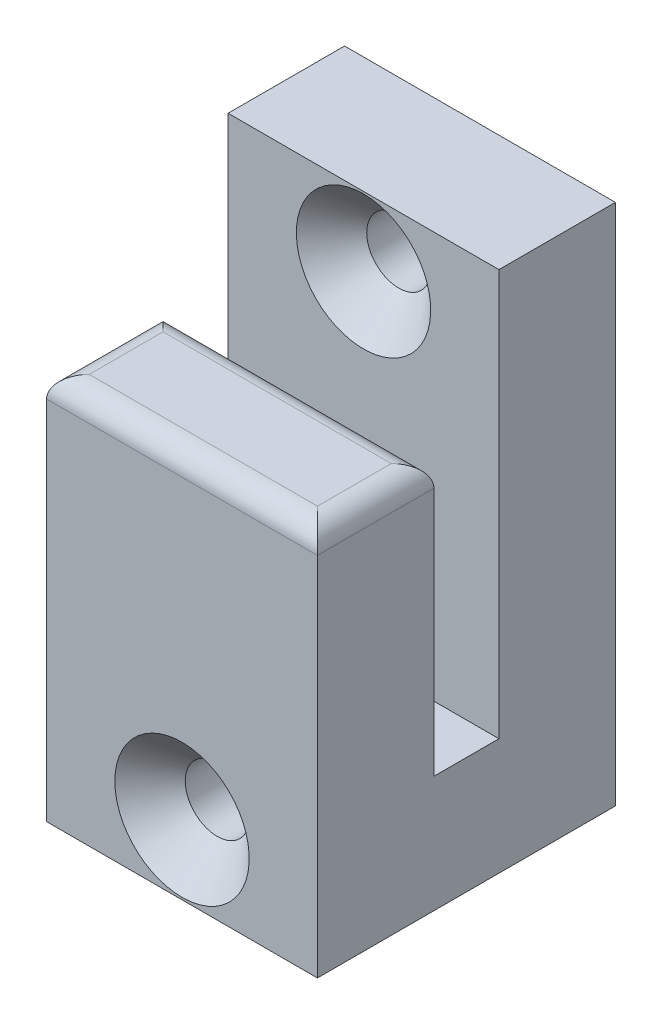
ISO-10303-21;
HEADER;
FILE_DESCRIPTION(('STEP AP214'),'2;1');
FILE_NAME('part.step','',(''),(''),'','','');
FILE_SCHEMA(('AUTOMOTIVE_DESIGN { 1 0 10303 214 1 1 1 1 }'));
ENDSEC;
DATA;
#1=APPLICATION_CONTEXT('core data for automotive mechanical design processes');
#2=APPLICATION_PROTOCOL_DEFINITION('international standard','automotive_design',2000,#1);
#3=PRODUCT_CONTEXT('',#1,'mechanical');
#4=PRODUCT('Part','Part','',(#3));
#5=PRODUCT_RELATED_PRODUCT_CATEGORY('part','',(#4));
#6=PRODUCT_DEFINITION_FORMATION('','',#4);
#7=PRODUCT_DEFINITION_CONTEXT('part definition',#1,'design');
#8=PRODUCT_DEFINITION('design','',#6,#7);
#9=PRODUCT_DEFINITION_SHAPE('','',#8);
#10=(LENGTH_UNIT() NAMED_UNIT(*) SI_UNIT(.MILLI.,.METRE.));
#11=(NAMED_UNIT(*) PLANE_ANGLE_UNIT() SI_UNIT($,.RADIAN.));
#12=(NAMED_UNIT(*) SI_UNIT($,.STERADIAN.) SOLID_ANGLE_UNIT());
#13=UNCERTAINTY_MEASURE_WITH_UNIT(LENGTH_MEASURE(1.E-05),#10,'distance_accuracy_value','');
#14=(GEOMETRIC_REPRESENTATION_CONTEXT(3) GLOBAL_UNCERTAINTY_ASSIGNED_CONTEXT((#13)) GLOBAL_UNIT_ASSIGNED_CONTEXT((#10,
#11,#12)) REPRESENTATION_CONTEXT('',''));
#15=CARTESIAN_POINT('',(0.,0.,0.));
#16=DIRECTION('',(0.,0.,1.));
#17=DIRECTION('',(1.,0.,0.));
#18=AXIS2_PLACEMENT_3D('',#15,#16,#17);
#19=CARTESIAN_POINT('',(25.4,-20.8635297619048,11.8928333333333));
#20=DIRECTION('',(0.,0.,-1.));
#21=DIRECTION('',(-1.,0.,0.));
#22=AXIS2_PLACEMENT_3D('',#19,#20,#21);
#23=PLANE('',#22);
#24=CARTESIAN_POINT('',(12.7,-14.3635297619048,11.8928333333333));
#25=DIRECTION('',(0.,0.,-1.));
#26=DIRECTION('',(-1.,0.,0.));
#27=AXIS2_PLACEMENT_3D('',#24,#25,#26);
#28=CIRCLE('',#27,6.3);
#29=CARTESIAN_POINT('',(6.39999999999999,-14.3635297619048,11.8928333333333));
#30=VERTEX_POINT('',#29);
#31=EDGE_CURVE('E150',#30,#30,#28,.T.);
#32=ORIENTED_EDGE('',*,*,#31,.T.);
#33=EDGE_LOOP('',(#32));
#34=FACE_BOUND('',#33,.T.);
#35=DIRECTION('',(0.,-1.,0.));
#36=VECTOR('',#35,1.);
#37=CARTESIAN_POINT('',(25.4,-20.8635297619048,11.8928333333333));
#38=LINE('',#37,#36);
#39=CARTESIAN_POINT('',(25.4,13.4584702380952,11.8928333333333));
#40=VERTEX_POINT('',#39);
#41=CARTESIAN_POINT('',(25.4,-20.8635297619048,11.8928333333333));
#42=VERTEX_POINT('',#41);
#43=EDGE_CURVE('E128',#40,#42,#38,.T.);
#44=ORIENTED_EDGE('',*,*,#43,.F.);
#45=DIRECTION('',(-1.,0.,0.));
#46=VECTOR('',#45,1.);
#47=CARTESIAN_POINT('',(25.4,13.4584702380952,11.8928333333333));
#48=LINE('',#47,#46);
#49=CARTESIAN_POINT('',(0.,13.4584702380952,11.8928333333333));
#50=VERTEX_POINT('',#49);
#51=EDGE_CURVE('E62',#40,#50,#48,.T.);
#52=ORIENTED_EDGE('',*,*,#51,.T.);
#53=DIRECTION('',(0.,-1.,0.));
#54=VECTOR('',#53,1.);
#55=CARTESIAN_POINT('',(0.,-20.8635297619048,11.8928333333333));
#56=LINE('',#55,#54);
#57=CARTESIAN_POINT('',(0.,-20.8635297619048,11.8928333333333));
#58=VERTEX_POINT('',#57);
#59=EDGE_CURVE('E147',#50,#58,#56,.T.);
#60=ORIENTED_EDGE('',*,*,#59,.T.);
#61=DIRECTION('',(-1.,0.,0.));
#62=VECTOR('',#61,1.);
#63=CARTESIAN_POINT('',(25.4,-20.8635297619048,11.8928333333333));
#64=LINE('',#63,#62);
#65=EDGE_CURVE('E140',#42,#58,#64,.T.);
#66=ORIENTED_EDGE('',*,*,#65,.F.);
#67=EDGE_LOOP('',(#44,#52,#60,#66));
#68=FACE_BOUND('',#67,.T.);
#69=ADVANCED_FACE('F52',(#34,#68),#23,.F.);
#70=CARTESIAN_POINT('',(25.4,-20.8635297619048,-16.0511666666667));
#71=DIRECTION('',(0.,1.,0.));
#72=DIRECTION('',(0.,0.,1.));
#73=AXIS2_PLACEMENT_3D('',#70,#71,#72);
#74=PLANE('',#73);
#75=DIRECTION('',(0.,0.,-1.));
#76=VECTOR('',#75,1.);
#77=CARTESIAN_POINT('',(0.,-20.8635297619048,-16.0511666666667));
#78=LINE('',#77,#76);
#79=CARTESIAN_POINT('',(0.,-20.8635297619048,-16.0511666666667));
#80=VERTEX_POINT('',#79);
#81=EDGE_CURVE('E203',#58,#80,#78,.T.);
#82=ORIENTED_EDGE('',*,*,#81,.T.);
#83=DIRECTION('',(-1.,0.,0.));
#84=VECTOR('',#83,1.);
#85=CARTESIAN_POINT('',(25.4,-20.8635297619048,-16.0511666666667));
#86=LINE('',#85,#84);
#87=CARTESIAN_POINT('',(25.4,-20.8635297619048,-16.0511666666667));
#88=VERTEX_POINT('',#87);
#89=EDGE_CURVE('E142',#88,#80,#86,.T.);
#90=ORIENTED_EDGE('',*,*,#89,.F.);
#91=DIRECTION('',(0.,0.,-1.));
#92=VECTOR('',#91,1.);
#93=CARTESIAN_POINT('',(25.4,-20.8635297619048,-16.0511666666667));
#94=LINE('',#93,#92);
#95=EDGE_CURVE('E131',#42,#88,#94,.T.);
#96=ORIENTED_EDGE('',*,*,#95,.F.);
#97=ORIENTED_EDGE('',*,*,#65,.T.);
#98=EDGE_LOOP('',(#82,#90,#96,#97));
#99=FACE_BOUND('',#98,.T.);
#100=ADVANCED_FACE('F139',(#99),#74,.F.);
#101=CARTESIAN_POINT('',(25.4,-20.8635297619048,-16.0511666666667));
#102=DIRECTION('',(0.,0.,1.));
#103=DIRECTION('',(1.,0.,0.));
#104=AXIS2_PLACEMENT_3D('',#101,#102,#103);
#105=PLANE('',#104);
#106=CARTESIAN_POINT('',(12.7,21.6584702380952,-16.0511666666667));
#107=DIRECTION('',(0.,0.,-1.));
#108=DIRECTION('',(-1.,0.,0.));
#109=AXIS2_PLACEMENT_3D('',#106,#107,#108);
#110=CIRCLE('',#109,3.);
#111=CARTESIAN_POINT('',(9.7,21.6584702380952,-16.0511666666667));
#112=VERTEX_POINT('',#111);
#113=EDGE_CURVE('E174',#112,#112,#110,.T.);
#114=ORIENTED_EDGE('',*,*,#113,.F.);
#115=EDGE_LOOP('',(#114));
#116=FACE_BOUND('',#115,.T.);
#117=CARTESIAN_POINT('',(12.7,-14.3635297619048,-16.0511666666667));
#118=DIRECTION('',(0.,0.,-1.));
#119=DIRECTION('',(-1.,0.,0.));
#120=AXIS2_PLACEMENT_3D('',#117,#118,#119);
#121=CIRCLE('',#120,3.);
#122=CARTESIAN_POINT('',(9.7,-14.3635297619048,-16.0511666666667));
#123=VERTEX_POINT('',#122);
#124=EDGE_CURVE('E170',#123,#123,#121,.T.);
#125=ORIENTED_EDGE('',*,*,#124,.F.);
#126=EDGE_LOOP('',(#125));
#127=FACE_BOUND('',#126,.T.);
#128=DIRECTION('',(0.,1.,0.));
#129=VECTOR('',#128,1.);
#130=CARTESIAN_POINT('',(0.,-20.8635297619048,-16.0511666666667));
#131=LINE('',#130,#129);
#132=CARTESIAN_POINT('',(0.,28.1584702380952,-16.0511666666667));
#133=VERTEX_POINT('',#132);
#134=EDGE_CURVE('E206',#80,#133,#131,.T.);
#135=ORIENTED_EDGE('',*,*,#134,.T.);
#136=DIRECTION('',(-1.,0.,0.));
#137=VECTOR('',#136,1.);
#138=CARTESIAN_POINT('',(25.4,28.1584702380952,-16.0511666666667));
#139=LINE('',#138,#137);
#140=CARTESIAN_POINT('',(25.4,28.1584702380952,-16.0511666666667));
#141=VERTEX_POINT('',#140);
#142=EDGE_CURVE('E158',#141,#133,#139,.T.);
#143=ORIENTED_EDGE('',*,*,#142,.F.);
#144=DIRECTION('',(0.,1.,0.));
#145=VECTOR('',#144,1.);
#146=CARTESIAN_POINT('',(25.4,-20.8635297619048,-16.0511666666667));
#147=LINE('',#146,#145);
#148=EDGE_CURVE('E145',#88,#141,#147,.T.);
#149=ORIENTED_EDGE('',*,*,#148,.F.);
#150=ORIENTED_EDGE('',*,*,#89,.T.);
#151=EDGE_LOOP('',(#135,#143,#149,#150));
#152=FACE_BOUND('',#151,.T.);
#153=ADVANCED_FACE('F315',(#116,#127,#152),#105,.F.);
#154=CARTESIAN_POINT('',(25.4,28.1584702380952,-16.0511666666667));
#155=DIRECTION('',(0.,-1.,0.));
#156=DIRECTION('',(0.,0.,-1.));
#157=AXIS2_PLACEMENT_3D('',#154,#155,#156);
#158=PLANE('',#157);
#159=DIRECTION('',(0.,0.,1.));
#160=VECTOR('',#159,1.);
#161=CARTESIAN_POINT('',(0.,28.1584702380952,-16.0511666666667));
#162=LINE('',#161,#160);
#163=CARTESIAN_POINT('',(0.,28.1584702380952,-5.12916666666667));
#164=VERTEX_POINT('',#163);
#165=EDGE_CURVE('E209',#133,#164,#162,.T.);
#166=ORIENTED_EDGE('',*,*,#165,.T.);
#167=DIRECTION('',(-1.,0.,0.));
#168=VECTOR('',#167,1.);
#169=CARTESIAN_POINT('',(25.4,28.1584702380952,-5.12916666666667));
#170=LINE('',#169,#168);
#171=CARTESIAN_POINT('',(25.4,28.1584702380952,-5.12916666666667));
#172=VERTEX_POINT('',#171);
#173=EDGE_CURVE('E227',#172,#164,#170,.T.);
#174=ORIENTED_EDGE('',*,*,#173,.F.);
#175=DIRECTION('',(0.,0.,1.));
#176=VECTOR('',#175,1.);
#177=CARTESIAN_POINT('',(25.4,28.1584702380952,-16.0511666666667));
#178=LINE('',#177,#176);
#179=EDGE_CURVE('E179',#141,#172,#178,.T.);
#180=ORIENTED_EDGE('',*,*,#179,.F.);
#181=ORIENTED_EDGE('',*,*,#142,.T.);
#182=EDGE_LOOP('',(#166,#174,#180,#181));
#183=FACE_BOUND('',#182,.T.);
#184=ADVANCED_FACE('F238',(#183),#158,.F.);
#185=CARTESIAN_POINT('',(25.4,28.1584702380952,-5.12916666666667));
#186=DIRECTION('',(0.,0.,-1.));
#187=DIRECTION('',(0.,1.,0.));
#188=AXIS2_PLACEMENT_3D('',#185,#186,#187);
#189=PLANE('',#188);
#190=CARTESIAN_POINT('',(12.7,21.6584702380952,-5.12916666666667));
#191=DIRECTION('',(0.,0.,-1.));
#192=DIRECTION('',(0.,1.,0.));
#193=AXIS2_PLACEMENT_3D('',#190,#191,#192);
#194=CIRCLE('',#193,6.29999999999999);
#195=CARTESIAN_POINT('',(12.7,27.9584702380952,-5.12916666666667));
#196=VERTEX_POINT('',#195);
#197=EDGE_CURVE('E293',#196,#196,#194,.T.);
#198=ORIENTED_EDGE('',*,*,#197,.T.);
#199=EDGE_LOOP('',(#198));
#200=FACE_BOUND('',#199,.T.);
#201=DIRECTION('',(0.,-1.,0.));
#202=VECTOR('',#201,1.);
#203=CARTESIAN_POINT('',(0.,28.1584702380952,-5.12916666666667));
#204=LINE('',#203,#202);
#205=CARTESIAN_POINT('',(0.,-9.94152976190476,-5.12916666666667));
#206=VERTEX_POINT('',#205);
#207=EDGE_CURVE('E212',#164,#206,#204,.T.);
#208=ORIENTED_EDGE('',*,*,#207,.T.);
#209=DIRECTION('',(-1.,0.,0.));
#210=VECTOR('',#209,1.);
#211=CARTESIAN_POINT('',(25.4,-9.94152976190476,-5.12916666666667));
#212=LINE('',#211,#210);
#213=CARTESIAN_POINT('',(25.4,-9.94152976190476,-5.12916666666667));
#214=VERTEX_POINT('',#213);
#215=EDGE_CURVE('E222',#214,#206,#212,.T.);
#216=ORIENTED_EDGE('',*,*,#215,.F.);
#217=DIRECTION('',(0.,-1.,0.));
#218=VECTOR('',#217,1.);
#219=CARTESIAN_POINT('',(25.4,28.1584702380952,-5.12916666666667));
#220=LINE('',#219,#218);
#221=EDGE_CURVE('E182',#172,#214,#220,.T.);
#222=ORIENTED_EDGE('',*,*,#221,.F.);
#223=ORIENTED_EDGE('',*,*,#173,.T.);
#224=EDGE_LOOP('',(#208,#216,#222,#223));
#225=FACE_BOUND('',#224,.T.);
#226=ADVANCED_FACE('F249',(#200,#225),#189,.F.);
#227=CARTESIAN_POINT('',(25.4,-9.94152976190476,-5.12916666666667));
#228=DIRECTION('',(0.,-1.,0.));
#229=DIRECTION('',(0.,0.,-1.));
#230=AXIS2_PLACEMENT_3D('',#227,#228,#229);
#231=PLANE('',#230);
#232=DIRECTION('',(0.,0.,1.));
#233=VECTOR('',#232,1.);
#234=CARTESIAN_POINT('',(0.,-9.94152976190476,-5.12916666666667));
#235=LINE('',#234,#233);
#236=CARTESIAN_POINT('',(0.,-9.94152976190476,0.970833333333327));
#237=VERTEX_POINT('',#236);
#238=EDGE_CURVE('E216',#206,#237,#235,.T.);
#239=ORIENTED_EDGE('',*,*,#238,.T.);
#240=DIRECTION('',(-1.,0.,0.));
#241=VECTOR('',#240,1.);
#242=CARTESIAN_POINT('',(25.4,-9.94152976190476,0.970833333333327));
#243=LINE('',#242,#241);
#244=CARTESIAN_POINT('',(25.4,-9.94152976190476,0.970833333333327));
#245=VERTEX_POINT('',#244);
#246=EDGE_CURVE('E200',#245,#237,#243,.T.);
#247=ORIENTED_EDGE('',*,*,#246,.F.);
#248=DIRECTION('',(0.,0.,1.));
#249=VECTOR('',#248,1.);
#250=CARTESIAN_POINT('',(25.4,-9.94152976190476,-5.12916666666667));
#251=LINE('',#250,#249);
#252=EDGE_CURVE('E186',#214,#245,#251,.T.);
#253=ORIENTED_EDGE('',*,*,#252,.F.);
#254=ORIENTED_EDGE('',*,*,#215,.T.);
#255=EDGE_LOOP('',(#239,#247,#253,#254));
#256=FACE_BOUND('',#255,.T.);
#257=ADVANCED_FACE('F253',(#256),#231,.F.);
#258=CARTESIAN_POINT('',(25.4,15.4584702380952,0.970833333333331));
#259=DIRECTION('',(0.,0.,1.));
#260=DIRECTION('',(0.,-1.,0.));
#261=AXIS2_PLACEMENT_3D('',#258,#259,#260);
#262=PLANE('',#261);
#263=DIRECTION('',(0.,1.,0.));
#264=VECTOR('',#263,1.);
#265=CARTESIAN_POINT('',(0.,15.4584702380952,0.970833333333331));
#266=LINE('',#265,#264);
#267=CARTESIAN_POINT('',(0.,13.4584702380952,0.97083333333333));
#268=VERTEX_POINT('',#267);
#269=EDGE_CURVE('E135',#237,#268,#266,.T.);
#270=ORIENTED_EDGE('',*,*,#269,.T.);
#271=DIRECTION('',(-1.,0.,0.));
#272=VECTOR('',#271,1.);
#273=CARTESIAN_POINT('',(25.4,13.4584702380952,0.97083333333333));
#274=LINE('',#273,#272);
#275=CARTESIAN_POINT('',(25.4,13.4584702380952,0.97083333333333));
#276=VERTEX_POINT('',#275);
#277=EDGE_CURVE('E286',#268,#276,#274,.F.);
#278=ORIENTED_EDGE('',*,*,#277,.T.);
#279=DIRECTION('',(0.,1.,0.));
#280=VECTOR('',#279,1.);
#281=CARTESIAN_POINT('',(25.4,15.4584702380952,0.970833333333331));
#282=LINE('',#281,#280);
#283=EDGE_CURVE('E196',#245,#276,#282,.T.);
#284=ORIENTED_EDGE('',*,*,#283,.F.);
#285=ORIENTED_EDGE('',*,*,#246,.T.);
#286=EDGE_LOOP('',(#270,#278,#284,#285));
#287=FACE_BOUND('',#286,.T.);
#288=ADVANCED_FACE('F374',(#287),#262,.F.);
#289=CARTESIAN_POINT('',(25.4,15.4584702380952,0.970833333333331));
#290=DIRECTION('',(0.,-1.,0.));
#291=DIRECTION('',(0.,0.,-1.));
#292=AXIS2_PLACEMENT_3D('',#289,#290,#291);
#293=PLANE('',#292);
#294=DIRECTION('',(0.,0.,1.));
#295=VECTOR('',#294,1.);
#296=CARTESIAN_POINT('',(23.4,15.4584702380952,0.970833333333331));
#297=LINE('',#296,#295);
#298=CARTESIAN_POINT('',(23.4,15.4584702380952,9.89283333333333));
#299=VERTEX_POINT('',#298);
#300=CARTESIAN_POINT('',(23.4,15.4584702380952,2.97083333333333));
#301=VERTEX_POINT('',#300);
#302=EDGE_CURVE('E269',#299,#301,#297,.F.);
#303=ORIENTED_EDGE('',*,*,#302,.T.);
#304=DIRECTION('',(-1.,0.,0.));
#305=VECTOR('',#304,1.);
#306=CARTESIAN_POINT('',(25.4,15.4584702380952,2.97083333333333));
#307=LINE('',#306,#305);
#308=CARTESIAN_POINT('',(2.,15.4584702380952,2.97083333333333));
#309=VERTEX_POINT('',#308);
#310=EDGE_CURVE('E272',#301,#309,#307,.T.);
#311=ORIENTED_EDGE('',*,*,#310,.T.);
#312=DIRECTION('',(0.,0.,1.));
#313=VECTOR('',#312,1.);
#314=CARTESIAN_POINT('',(2.,15.4584702380952,0.970833333333331));
#315=LINE('',#314,#313);
#316=CARTESIAN_POINT('',(2.,15.4584702380952,9.89283333333333));
#317=VERTEX_POINT('',#316);
#318=EDGE_CURVE('E264',#309,#317,#315,.T.);
#319=ORIENTED_EDGE('',*,*,#318,.T.);
#320=DIRECTION('',(-1.,0.,0.));
#321=VECTOR('',#320,1.);
#322=CARTESIAN_POINT('',(25.4,15.4584702380952,9.89283333333333));
#323=LINE('',#322,#321);
#324=EDGE_CURVE('E266',#317,#299,#323,.F.);
#325=ORIENTED_EDGE('',*,*,#324,.T.);
#326=EDGE_LOOP('',(#303,#311,#319,#325));
#327=FACE_BOUND('',#326,.T.);
#328=ADVANCED_FACE('F370',(#327),#293,.F.);
#329=CARTESIAN_POINT('',(25.4,0.,0.));
#330=DIRECTION('',(1.,0.,0.));
#331=DIRECTION('',(0.,0.,-1.));
#332=AXIS2_PLACEMENT_3D('',#329,#330,#331);
#333=PLANE('',#332);
#334=ORIENTED_EDGE('',*,*,#283,.T.);
#335=DIRECTION('',(0.,0.,1.));
#336=VECTOR('',#335,1.);
#337=CARTESIAN_POINT('',(25.4,13.4584702380952,11.8928333333333));
#338=LINE('',#337,#336);
#339=EDGE_CURVE('E77',#276,#40,#338,.T.);
#340=ORIENTED_EDGE('',*,*,#339,.T.);
#341=ORIENTED_EDGE('',*,*,#43,.T.);
#342=ORIENTED_EDGE('',*,*,#95,.T.);
#343=ORIENTED_EDGE('',*,*,#148,.T.);
#344=ORIENTED_EDGE('',*,*,#179,.T.);
#345=ORIENTED_EDGE('',*,*,#221,.T.);
#346=ORIENTED_EDGE('',*,*,#252,.T.);
#347=EDGE_LOOP('',(#334,#340,#341,#342,#343,#344,#345,#346));
#348=FACE_BOUND('',#347,.T.);
#349=ADVANCED_FACE('F130',(#348),#333,.T.);
#350=CARTESIAN_POINT('',(0.,0.,0.));
#351=DIRECTION('',(1.,0.,0.));
#352=DIRECTION('',(0.,0.,-1.));
#353=AXIS2_PLACEMENT_3D('',#350,#351,#352);
#354=PLANE('',#353);
#355=ORIENTED_EDGE('',*,*,#59,.F.);
#356=DIRECTION('',(0.,0.,1.));
#357=VECTOR('',#356,1.);
#358=CARTESIAN_POINT('',(0.,13.4584702380952,0.));
#359=LINE('',#358,#357);
#360=EDGE_CURVE('E12',#50,#268,#359,.F.);
#361=ORIENTED_EDGE('',*,*,#360,.T.);
#362=ORIENTED_EDGE('',*,*,#269,.F.);
#363=ORIENTED_EDGE('',*,*,#238,.F.);
#364=ORIENTED_EDGE('',*,*,#207,.F.);
#365=ORIENTED_EDGE('',*,*,#165,.F.);
#366=ORIENTED_EDGE('',*,*,#134,.F.);
#367=ORIENTED_EDGE('',*,*,#81,.F.);
#368=EDGE_LOOP('',(#355,#361,#362,#363,#364,#365,#366,#367));
#369=FACE_BOUND('',#368,.T.);
#370=ADVANCED_FACE('F244',(#369),#354,.F.);
#371=CARTESIAN_POINT('',(12.7,21.6584702380952,11.8928333333333));
#372=DIRECTION('',(0.,0.,-1.));
#373=DIRECTION('',(-1.,0.,0.));
#374=AXIS2_PLACEMENT_3D('',#371,#372,#373);
#375=CYLINDRICAL_SURFACE('',#374,3.);
#376=CARTESIAN_POINT('',(12.7,21.6584702380952,-8.42916666666667));
#377=DIRECTION('',(0.,0.,-1.));
#378=DIRECTION('',(-1.,0.,0.));
#379=AXIS2_PLACEMENT_3D('',#376,#377,#378);
#380=CIRCLE('',#379,3.);
#381=CARTESIAN_POINT('',(9.7,21.6584702380952,-8.42916666666667));
#382=VERTEX_POINT('',#381);
#383=EDGE_CURVE('E267',#382,#382,#380,.F.);
#384=ORIENTED_EDGE('',*,*,#383,.T.);
#385=EDGE_LOOP('',(#384));
#386=FACE_BOUND('',#385,.T.);
#387=ORIENTED_EDGE('',*,*,#113,.T.);
#388=EDGE_LOOP('',(#387));
#389=FACE_BOUND('',#388,.T.);
#390=ADVANCED_FACE('F428',(#386,#389),#375,.F.);
#391=CARTESIAN_POINT('',(12.7,-14.3635297619048,11.8928333333333));
#392=DIRECTION('',(0.,0.,-1.));
#393=DIRECTION('',(-1.,0.,0.));
#394=AXIS2_PLACEMENT_3D('',#391,#392,#393);
#395=CYLINDRICAL_SURFACE('',#394,3.);
#396=CARTESIAN_POINT('',(12.7,-14.3635297619048,8.59283333333332));
#397=DIRECTION('',(0.,0.,-1.));
#398=DIRECTION('',(-1.,0.,0.));
#399=AXIS2_PLACEMENT_3D('',#396,#397,#398);
#400=CIRCLE('',#399,3.);
#401=CARTESIAN_POINT('',(9.7,-14.3635297619048,8.59283333333332));
#402=VERTEX_POINT('',#401);
#403=EDGE_CURVE('E156',#402,#402,#400,.F.);
#404=ORIENTED_EDGE('',*,*,#403,.T.);
#405=EDGE_LOOP('',(#404));
#406=FACE_BOUND('',#405,.T.);
#407=ORIENTED_EDGE('',*,*,#124,.T.);
#408=EDGE_LOOP('',(#407));
#409=FACE_BOUND('',#408,.T.);
#410=ADVANCED_FACE('F300',(#406,#409),#395,.F.);
#411=CARTESIAN_POINT('',(12.7,-14.3635297619048,11.8928333333333));
#412=DIRECTION('',(0.,0.,1.));
#413=DIRECTION('',(1.,0.,0.));
#414=AXIS2_PLACEMENT_3D('',#411,#412,#413);
#415=CONICAL_SURFACE('',#414,6.3,0.785398163397447);
#416=ORIENTED_EDGE('',*,*,#403,.F.);
#417=EDGE_LOOP('',(#416));
#418=FACE_BOUND('',#417,.T.);
#419=ORIENTED_EDGE('',*,*,#31,.F.);
#420=EDGE_LOOP('',(#419));
#421=FACE_BOUND('',#420,.T.);
#422=ADVANCED_FACE('F303',(#418,#421),#415,.F.);
#423=CARTESIAN_POINT('',(12.7,21.6584702380952,-5.12916666666667));
#424=DIRECTION('',(0.,0.,1.));
#425=DIRECTION('',(1.,0.,0.));
#426=AXIS2_PLACEMENT_3D('',#423,#424,#425);
#427=CONICAL_SURFACE('',#426,6.29999999999999,0.785398163397447);
#428=ORIENTED_EDGE('',*,*,#383,.F.);
#429=EDGE_LOOP('',(#428));
#430=FACE_BOUND('',#429,.T.);
#431=ORIENTED_EDGE('',*,*,#197,.F.);
#432=EDGE_LOOP('',(#431));
#433=FACE_BOUND('',#432,.T.);
#434=ADVANCED_FACE('F306',(#430,#433),#427,.F.);
#435=CARTESIAN_POINT('',(25.4,13.4584702380952,9.89283333333333));
#436=DIRECTION('',(-1.,0.,0.));
#437=DIRECTION('',(0.,0.,1.));
#438=AXIS2_PLACEMENT_3D('',#435,#436,#437);
#439=CYLINDRICAL_SURFACE('',#438,2.);
#440=CARTESIAN_POINT('',(2.,13.4584702380952,9.89283333333333));
#441=DIRECTION('',(0.707106781186547,0.,0.707106781186547));
#442=DIRECTION('',(-0.707106781186547,0.,0.707106781186547));
#443=AXIS2_PLACEMENT_3D('',#440,#441,#442);
#444=ELLIPSE('',#443,2.82842712474619,2.);
#445=EDGE_CURVE('E348',#50,#317,#444,.F.);
#446=ORIENTED_EDGE('',*,*,#445,.F.);
#447=ORIENTED_EDGE('',*,*,#51,.F.);
#448=CARTESIAN_POINT('',(23.4,13.4584702380952,9.89283333333333));
#449=DIRECTION('',(-0.707106781186547,0.,0.707106781186547));
#450=DIRECTION('',(-0.707106781186547,0.,-0.707106781186547));
#451=AXIS2_PLACEMENT_3D('',#448,#449,#450);
#452=ELLIPSE('',#451,2.82842712474619,2.);
#453=EDGE_CURVE('E56',#299,#40,#452,.F.);
#454=ORIENTED_EDGE('',*,*,#453,.F.);
#455=ORIENTED_EDGE('',*,*,#324,.F.);
#456=EDGE_LOOP('',(#446,#447,#454,#455));
#457=FACE_BOUND('',#456,.T.);
#458=ADVANCED_FACE('F54',(#457),#439,.T.);
#459=CARTESIAN_POINT('',(23.4,13.4584702380952,0.));
#460=DIRECTION('',(0.,0.,-1.));
#461=DIRECTION('',(-1.,0.,0.));
#462=AXIS2_PLACEMENT_3D('',#459,#460,#461);
#463=CYLINDRICAL_SURFACE('',#462,2.);
#464=ORIENTED_EDGE('',*,*,#453,.T.);
#465=ORIENTED_EDGE('',*,*,#339,.F.);
#466=CARTESIAN_POINT('',(23.4,13.4584702380952,2.97083333333333));
#467=DIRECTION('',(-0.707106781186547,0.,-0.707106781186547));
#468=DIRECTION('',(0.707106781186547,0.,-0.707106781186547));
#469=AXIS2_PLACEMENT_3D('',#466,#467,#468);
#470=ELLIPSE('',#469,2.82842712474619,2.);
#471=EDGE_CURVE('E351',#301,#276,#470,.T.);
#472=ORIENTED_EDGE('',*,*,#471,.F.);
#473=ORIENTED_EDGE('',*,*,#302,.F.);
#474=EDGE_LOOP('',(#464,#465,#472,#473));
#475=FACE_BOUND('',#474,.T.);
#476=ADVANCED_FACE('F334',(#475),#463,.T.);
#477=CARTESIAN_POINT('',(2.,13.4584702380952,0.970833333333331));
#478=DIRECTION('',(0.,0.,1.));
#479=DIRECTION('',(1.,0.,0.));
#480=AXIS2_PLACEMENT_3D('',#477,#478,#479);
#481=CYLINDRICAL_SURFACE('',#480,2.);
#482=ORIENTED_EDGE('',*,*,#445,.T.);
#483=ORIENTED_EDGE('',*,*,#318,.F.);
#484=CARTESIAN_POINT('',(2.,13.4584702380952,2.97083333333333));
#485=DIRECTION('',(-0.707106781186547,0.,0.707106781186547));
#486=DIRECTION('',(0.707106781186547,0.,0.707106781186547));
#487=AXIS2_PLACEMENT_3D('',#484,#485,#486);
#488=ELLIPSE('',#487,2.82842712474619,2.);
#489=EDGE_CURVE('E356',#268,#309,#488,.F.);
#490=ORIENTED_EDGE('',*,*,#489,.F.);
#491=ORIENTED_EDGE('',*,*,#360,.F.);
#492=EDGE_LOOP('',(#482,#483,#490,#491));
#493=FACE_BOUND('',#492,.T.);
#494=ADVANCED_FACE('F331',(#493),#481,.T.);
#495=CARTESIAN_POINT('',(25.4,13.4584702380952,2.97083333333333));
#496=DIRECTION('',(-1.,0.,0.));
#497=DIRECTION('',(0.,0.,1.));
#498=AXIS2_PLACEMENT_3D('',#495,#496,#497);
#499=CYLINDRICAL_SURFACE('',#498,2.);
#500=ORIENTED_EDGE('',*,*,#471,.T.);
#501=ORIENTED_EDGE('',*,*,#277,.F.);
#502=ORIENTED_EDGE('',*,*,#489,.T.);
#503=ORIENTED_EDGE('',*,*,#310,.F.);
#504=EDGE_LOOP('',(#500,#501,#502,#503));
#505=FACE_BOUND('',#504,.T.);
#506=ADVANCED_FACE('F328',(#505),#499,.T.);
#507=CLOSED_SHELL('',(#69,#100,#153,#184,#226,#257,#288,#328,#349,#370,#390,#410,#422,#434,#458,
#476,#494,#506));
#508=MANIFOLD_SOLID_BREP('B2',#507);
#509=ADVANCED_BREP_SHAPE_REPRESENTATION('',(#18,#508),#14);
#510=SHAPE_DEFINITION_REPRESENTATION(#9,#509);
ENDSEC;
END-ISO-10303-21;
